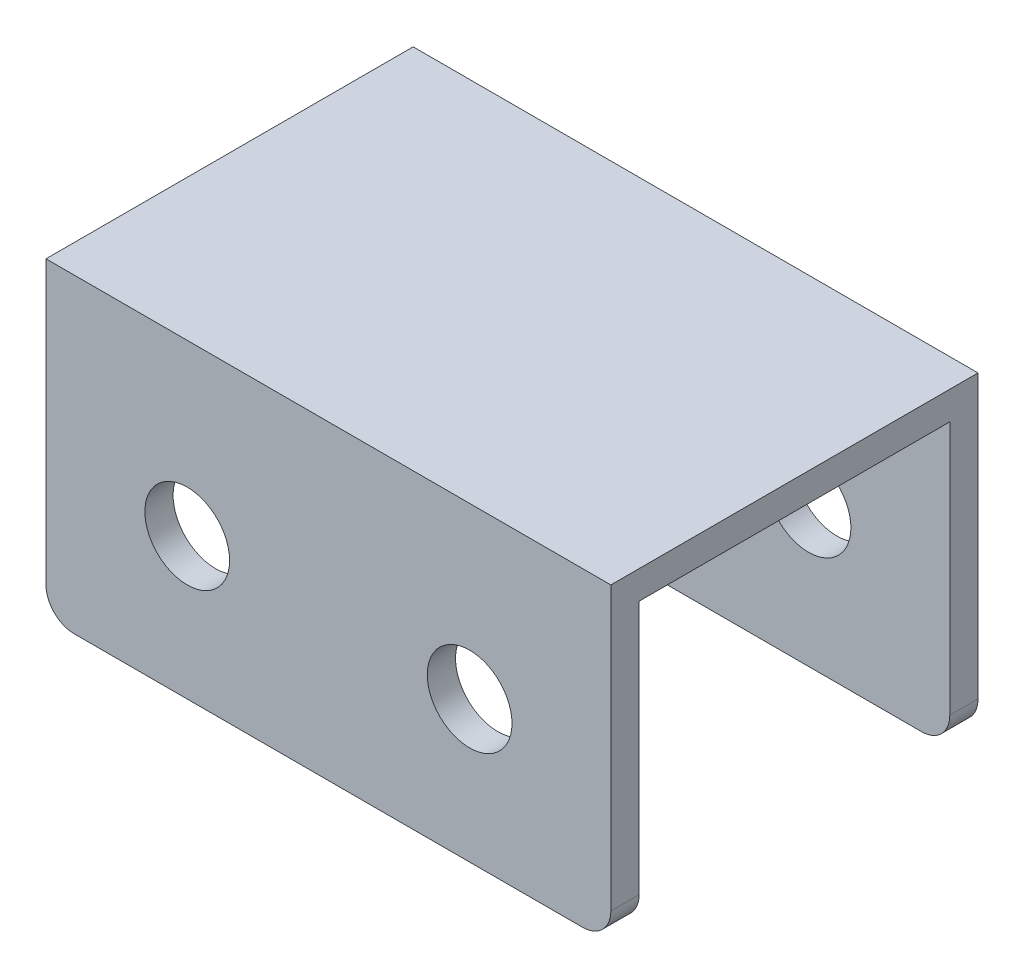
ISO-10303-21;
HEADER;
FILE_DESCRIPTION(('STEP AP214'),'2;1');
FILE_NAME('part.step','',(''),(''),'','','');
FILE_SCHEMA(('AUTOMOTIVE_DESIGN { 1 0 10303 214 1 1 1 1 }'));
ENDSEC;
DATA;
#1=APPLICATION_CONTEXT('core data for automotive mechanical design processes');
#2=APPLICATION_PROTOCOL_DEFINITION('international standard','automotive_design',2000,#1);
#3=PRODUCT_CONTEXT('',#1,'mechanical');
#4=PRODUCT('Part','Part','',(#3));
#5=PRODUCT_RELATED_PRODUCT_CATEGORY('part','',(#4));
#6=PRODUCT_DEFINITION_FORMATION('','',#4);
#7=PRODUCT_DEFINITION_CONTEXT('part definition',#1,'design');
#8=PRODUCT_DEFINITION('design','',#6,#7);
#9=PRODUCT_DEFINITION_SHAPE('','',#8);
#10=(LENGTH_UNIT() NAMED_UNIT(*) SI_UNIT(.MILLI.,.METRE.));
#11=(NAMED_UNIT(*) PLANE_ANGLE_UNIT() SI_UNIT($,.RADIAN.));
#12=(NAMED_UNIT(*) SI_UNIT($,.STERADIAN.) SOLID_ANGLE_UNIT());
#13=UNCERTAINTY_MEASURE_WITH_UNIT(LENGTH_MEASURE(1.E-05),#10,'distance_accuracy_value','');
#14=(GEOMETRIC_REPRESENTATION_CONTEXT(3) GLOBAL_UNCERTAINTY_ASSIGNED_CONTEXT((#13)) GLOBAL_UNIT_ASSIGNED_CONTEXT((#10,
#11,#12)) REPRESENTATION_CONTEXT('',''));
#15=CARTESIAN_POINT('',(0.,0.,0.));
#16=DIRECTION('',(0.,0.,1.));
#17=DIRECTION('',(1.,0.,0.));
#18=AXIS2_PLACEMENT_3D('',#15,#16,#17);
#19=CARTESIAN_POINT('',(50.,0.,-27.5));
#20=DIRECTION('',(0.,0.,-1.));
#21=DIRECTION('',(0.,1.,0.));
#22=AXIS2_PLACEMENT_3D('',#19,#20,#21);
#23=PLANE('',#22);
#24=CARTESIAN_POINT('',(25.,-25.,-27.5));
#25=DIRECTION('',(0.,0.,-1.));
#26=DIRECTION('',(0.,1.,0.));
#27=AXIS2_PLACEMENT_3D('',#24,#25,#26);
#28=CIRCLE('',#27,7.5);
#29=CARTESIAN_POINT('',(25.,-17.5,-27.5));
#30=VERTEX_POINT('',#29);
#31=EDGE_CURVE('E194',#30,#30,#28,.T.);
#32=ORIENTED_EDGE('',*,*,#31,.T.);
#33=EDGE_LOOP('',(#32));
#34=FACE_BOUND('',#33,.T.);
#35=CARTESIAN_POINT('',(-25.,-25.,-27.5));
#36=DIRECTION('',(0.,0.,-1.));
#37=DIRECTION('',(0.,1.,0.));
#38=AXIS2_PLACEMENT_3D('',#35,#36,#37);
#39=CIRCLE('',#38,7.5);
#40=CARTESIAN_POINT('',(-25.,-17.5,-27.5));
#41=VERTEX_POINT('',#40);
#42=EDGE_CURVE('E161',#41,#41,#39,.T.);
#43=ORIENTED_EDGE('',*,*,#42,.T.);
#44=EDGE_LOOP('',(#43));
#45=FACE_BOUND('',#44,.T.);
#46=DIRECTION('',(-1.,0.,0.));
#47=VECTOR('',#46,1.);
#48=CARTESIAN_POINT('',(50.,-50.,-27.5));
#49=LINE('',#48,#47);
#50=CARTESIAN_POINT('',(45.,-50.,-27.5));
#51=VERTEX_POINT('',#50);
#52=CARTESIAN_POINT('',(-45.,-50.,-27.5));
#53=VERTEX_POINT('',#52);
#54=EDGE_CURVE('E183',#51,#53,#49,.T.);
#55=ORIENTED_EDGE('',*,*,#54,.F.);
#56=CARTESIAN_POINT('',(45.,-45.,-27.5));
#57=DIRECTION('',(0.,0.,-1.));
#58=DIRECTION('',(0.,1.,0.));
#59=AXIS2_PLACEMENT_3D('',#56,#57,#58);
#60=CIRCLE('',#59,5.);
#61=CARTESIAN_POINT('',(50.,-45.,-27.5));
#62=VERTEX_POINT('',#61);
#63=EDGE_CURVE('E202',#51,#62,#60,.F.);
#64=ORIENTED_EDGE('',*,*,#63,.T.);
#65=DIRECTION('',(0.,-1.,0.));
#66=VECTOR('',#65,1.);
#67=CARTESIAN_POINT('',(50.,0.,-27.5));
#68=LINE('',#67,#66);
#69=CARTESIAN_POINT('',(50.,0.,-27.5));
#70=VERTEX_POINT('',#69);
#71=EDGE_CURVE('E143',#70,#62,#68,.T.);
#72=ORIENTED_EDGE('',*,*,#71,.F.);
#73=DIRECTION('',(-1.,0.,0.));
#74=VECTOR('',#73,1.);
#75=CARTESIAN_POINT('',(50.,0.,-27.5));
#76=LINE('',#75,#74);
#77=CARTESIAN_POINT('',(-50.,0.,-27.5));
#78=VERTEX_POINT('',#77);
#79=EDGE_CURVE('E157',#70,#78,#76,.T.);
#80=ORIENTED_EDGE('',*,*,#79,.T.);
#81=DIRECTION('',(0.,-1.,0.));
#82=VECTOR('',#81,1.);
#83=CARTESIAN_POINT('',(-50.,0.,-27.5));
#84=LINE('',#83,#82);
#85=CARTESIAN_POINT('',(-50.,-45.,-27.5));
#86=VERTEX_POINT('',#85);
#87=EDGE_CURVE('E158',#78,#86,#84,.T.);
#88=ORIENTED_EDGE('',*,*,#87,.T.);
#89=CARTESIAN_POINT('',(-45.,-45.,-27.5));
#90=DIRECTION('',(0.,0.,-1.));
#91=DIRECTION('',(0.,1.,0.));
#92=AXIS2_PLACEMENT_3D('',#89,#90,#91);
#93=CIRCLE('',#92,5.);
#94=EDGE_CURVE('E200',#86,#53,#93,.F.);
#95=ORIENTED_EDGE('',*,*,#94,.T.);
#96=EDGE_LOOP('',(#55,#64,#72,#80,#88,#95));
#97=FACE_BOUND('',#96,.T.);
#98=ADVANCED_FACE('F32',(#34,#45,#97),#23,.F.);
#99=CARTESIAN_POINT('',(50.,-50.,-32.5));
#100=DIRECTION('',(0.,-1.,0.));
#101=DIRECTION('',(0.,0.,-1.));
#102=AXIS2_PLACEMENT_3D('',#99,#100,#101);
#103=PLANE('',#102);
#104=DIRECTION('',(-1.,0.,0.));
#105=VECTOR('',#104,1.);
#106=CARTESIAN_POINT('',(50.,-50.,-32.5));
#107=LINE('',#106,#105);
#108=CARTESIAN_POINT('',(45.,-50.,-32.5));
#109=VERTEX_POINT('',#108);
#110=CARTESIAN_POINT('',(-45.,-50.,-32.5));
#111=VERTEX_POINT('',#110);
#112=EDGE_CURVE('E132',#109,#111,#107,.T.);
#113=ORIENTED_EDGE('',*,*,#112,.F.);
#114=DIRECTION('',(0.,0.,1.));
#115=VECTOR('',#114,1.);
#116=CARTESIAN_POINT('',(45.,-50.,-27.5));
#117=LINE('',#116,#115);
#118=EDGE_CURVE('E197',#109,#51,#117,.T.);
#119=ORIENTED_EDGE('',*,*,#118,.T.);
#120=ORIENTED_EDGE('',*,*,#54,.T.);
#121=DIRECTION('',(0.,0.,1.));
#122=VECTOR('',#121,1.);
#123=CARTESIAN_POINT('',(-45.,-50.,-32.5));
#124=LINE('',#123,#122);
#125=EDGE_CURVE('E186',#53,#111,#124,.F.);
#126=ORIENTED_EDGE('',*,*,#125,.T.);
#127=EDGE_LOOP('',(#113,#119,#120,#126));
#128=FACE_BOUND('',#127,.T.);
#129=ADVANCED_FACE('F254',(#128),#103,.T.);
#130=CARTESIAN_POINT('',(50.,0.,-32.5));
#131=DIRECTION('',(0.,0.,-1.));
#132=DIRECTION('',(0.,1.,0.));
#133=AXIS2_PLACEMENT_3D('',#130,#131,#132);
#134=PLANE('',#133);
#135=CARTESIAN_POINT('',(25.,-25.,-32.5));
#136=DIRECTION('',(0.,0.,1.));
#137=DIRECTION('',(1.,0.,0.));
#138=AXIS2_PLACEMENT_3D('',#135,#136,#137);
#139=CIRCLE('',#138,7.5);
#140=CARTESIAN_POINT('',(32.5,-25.,-32.5));
#141=VERTEX_POINT('',#140);
#142=EDGE_CURVE('E195',#141,#141,#139,.T.);
#143=ORIENTED_EDGE('',*,*,#142,.T.);
#144=EDGE_LOOP('',(#143));
#145=FACE_BOUND('',#144,.T.);
#146=CARTESIAN_POINT('',(-25.,-25.,-32.5));
#147=DIRECTION('',(0.,0.,1.));
#148=DIRECTION('',(1.,0.,0.));
#149=AXIS2_PLACEMENT_3D('',#146,#147,#148);
#150=CIRCLE('',#149,7.5);
#151=CARTESIAN_POINT('',(-17.5,-25.,-32.5));
#152=VERTEX_POINT('',#151);
#153=EDGE_CURVE('E190',#152,#152,#150,.T.);
#154=ORIENTED_EDGE('',*,*,#153,.T.);
#155=EDGE_LOOP('',(#154));
#156=FACE_BOUND('',#155,.T.);
#157=DIRECTION('',(0.,-1.,0.));
#158=VECTOR('',#157,1.);
#159=CARTESIAN_POINT('',(50.,0.,-32.5));
#160=LINE('',#159,#158);
#161=CARTESIAN_POINT('',(50.,5.,-32.5));
#162=VERTEX_POINT('',#161);
#163=CARTESIAN_POINT('',(50.,-45.,-32.5));
#164=VERTEX_POINT('',#163);
#165=EDGE_CURVE('E124',#162,#164,#160,.T.);
#166=ORIENTED_EDGE('',*,*,#165,.T.);
#167=CARTESIAN_POINT('',(45.,-45.,-32.5));
#168=DIRECTION('',(0.,0.,-1.));
#169=DIRECTION('',(0.,1.,0.));
#170=AXIS2_PLACEMENT_3D('',#167,#168,#169);
#171=CIRCLE('',#170,5.);
#172=EDGE_CURVE('E209',#164,#109,#171,.T.);
#173=ORIENTED_EDGE('',*,*,#172,.T.);
#174=ORIENTED_EDGE('',*,*,#112,.T.);
#175=CARTESIAN_POINT('',(-45.,-45.,-32.5));
#176=DIRECTION('',(0.,0.,-1.));
#177=DIRECTION('',(0.,1.,0.));
#178=AXIS2_PLACEMENT_3D('',#175,#176,#177);
#179=CIRCLE('',#178,5.);
#180=CARTESIAN_POINT('',(-50.,-45.,-32.5));
#181=VERTEX_POINT('',#180);
#182=EDGE_CURVE('E207',#111,#181,#179,.T.);
#183=ORIENTED_EDGE('',*,*,#182,.T.);
#184=DIRECTION('',(0.,-1.,0.));
#185=VECTOR('',#184,1.);
#186=CARTESIAN_POINT('',(-50.,0.,-32.5));
#187=LINE('',#186,#185);
#188=CARTESIAN_POINT('',(-50.,5.,-32.5));
#189=VERTEX_POINT('',#188);
#190=EDGE_CURVE('E127',#189,#181,#187,.T.);
#191=ORIENTED_EDGE('',*,*,#190,.F.);
#192=DIRECTION('',(-1.,0.,0.));
#193=VECTOR('',#192,1.);
#194=CARTESIAN_POINT('',(50.,5.,-32.5));
#195=LINE('',#194,#193);
#196=EDGE_CURVE('E121',#162,#189,#195,.T.);
#197=ORIENTED_EDGE('',*,*,#196,.F.);
#198=EDGE_LOOP('',(#166,#173,#174,#183,#191,#197));
#199=FACE_BOUND('',#198,.T.);
#200=ADVANCED_FACE('F123',(#145,#156,#199),#134,.T.);
#201=CARTESIAN_POINT('',(50.,5.,27.5));
#202=DIRECTION('',(0.,1.,0.));
#203=DIRECTION('',(0.,0.,1.));
#204=AXIS2_PLACEMENT_3D('',#201,#202,#203);
#205=PLANE('',#204);
#206=DIRECTION('',(0.,0.,-1.));
#207=VECTOR('',#206,1.);
#208=CARTESIAN_POINT('',(-50.,5.,27.5));
#209=LINE('',#208,#207);
#210=CARTESIAN_POINT('',(-50.,5.,32.5));
#211=VERTEX_POINT('',#210);
#212=EDGE_CURVE('E163',#211,#189,#209,.T.);
#213=ORIENTED_EDGE('',*,*,#212,.F.);
#214=DIRECTION('',(-1.,0.,0.));
#215=VECTOR('',#214,1.);
#216=CARTESIAN_POINT('',(50.,5.,32.5));
#217=LINE('',#216,#215);
#218=CARTESIAN_POINT('',(50.,5.,32.5));
#219=VERTEX_POINT('',#218);
#220=EDGE_CURVE('E133',#219,#211,#217,.T.);
#221=ORIENTED_EDGE('',*,*,#220,.F.);
#222=DIRECTION('',(0.,0.,-1.));
#223=VECTOR('',#222,1.);
#224=CARTESIAN_POINT('',(50.,5.,27.5));
#225=LINE('',#224,#223);
#226=EDGE_CURVE('E140',#219,#162,#225,.T.);
#227=ORIENTED_EDGE('',*,*,#226,.T.);
#228=ORIENTED_EDGE('',*,*,#196,.T.);
#229=EDGE_LOOP('',(#213,#221,#227,#228));
#230=FACE_BOUND('',#229,.T.);
#231=ADVANCED_FACE('F146',(#230),#205,.T.);
#232=CARTESIAN_POINT('',(50.,-50.,32.5));
#233=DIRECTION('',(0.,0.,1.));
#234=DIRECTION('',(0.,-1.,0.));
#235=AXIS2_PLACEMENT_3D('',#232,#233,#234);
#236=PLANE('',#235);
#237=CARTESIAN_POINT('',(25.,-25.,32.5));
#238=DIRECTION('',(0.,0.,1.));
#239=DIRECTION('',(1.,0.,0.));
#240=AXIS2_PLACEMENT_3D('',#237,#238,#239);
#241=CIRCLE('',#240,7.5);
#242=CARTESIAN_POINT('',(32.5,-25.,32.5));
#243=VERTEX_POINT('',#242);
#244=EDGE_CURVE('E292',#243,#243,#241,.T.);
#245=ORIENTED_EDGE('',*,*,#244,.F.);
#246=EDGE_LOOP('',(#245));
#247=FACE_BOUND('',#246,.T.);
#248=CARTESIAN_POINT('',(-25.,-25.,32.5));
#249=DIRECTION('',(0.,0.,1.));
#250=DIRECTION('',(1.,0.,0.));
#251=AXIS2_PLACEMENT_3D('',#248,#249,#250);
#252=CIRCLE('',#251,7.5);
#253=CARTESIAN_POINT('',(-17.5,-25.,32.5));
#254=VERTEX_POINT('',#253);
#255=EDGE_CURVE('E286',#254,#254,#252,.T.);
#256=ORIENTED_EDGE('',*,*,#255,.F.);
#257=EDGE_LOOP('',(#256));
#258=FACE_BOUND('',#257,.T.);
#259=DIRECTION('',(0.,1.,0.));
#260=VECTOR('',#259,1.);
#261=CARTESIAN_POINT('',(-50.,-50.,32.5));
#262=LINE('',#261,#260);
#263=CARTESIAN_POINT('',(-50.,-45.,32.5));
#264=VERTEX_POINT('',#263);
#265=EDGE_CURVE('E165',#264,#211,#262,.T.);
#266=ORIENTED_EDGE('',*,*,#265,.F.);
#267=CARTESIAN_POINT('',(-45.,-45.,32.5));
#268=DIRECTION('',(0.,0.,1.));
#269=DIRECTION('',(0.,-1.,0.));
#270=AXIS2_PLACEMENT_3D('',#267,#268,#269);
#271=CIRCLE('',#270,5.);
#272=CARTESIAN_POINT('',(-45.,-50.,32.5));
#273=VERTEX_POINT('',#272);
#274=EDGE_CURVE('E219',#264,#273,#271,.T.);
#275=ORIENTED_EDGE('',*,*,#274,.T.);
#276=DIRECTION('',(-1.,0.,0.));
#277=VECTOR('',#276,1.);
#278=CARTESIAN_POINT('',(50.,-50.,32.5));
#279=LINE('',#278,#277);
#280=CARTESIAN_POINT('',(45.,-50.,32.5));
#281=VERTEX_POINT('',#280);
#282=EDGE_CURVE('E178',#281,#273,#279,.T.);
#283=ORIENTED_EDGE('',*,*,#282,.F.);
#284=CARTESIAN_POINT('',(45.,-45.,32.5));
#285=DIRECTION('',(0.,0.,1.));
#286=DIRECTION('',(0.,-1.,0.));
#287=AXIS2_PLACEMENT_3D('',#284,#285,#286);
#288=CIRCLE('',#287,5.);
#289=CARTESIAN_POINT('',(50.,-45.,32.5));
#290=VERTEX_POINT('',#289);
#291=EDGE_CURVE('E217',#281,#290,#288,.T.);
#292=ORIENTED_EDGE('',*,*,#291,.T.);
#293=DIRECTION('',(0.,1.,0.));
#294=VECTOR('',#293,1.);
#295=CARTESIAN_POINT('',(50.,-50.,32.5));
#296=LINE('',#295,#294);
#297=EDGE_CURVE('E148',#290,#219,#296,.T.);
#298=ORIENTED_EDGE('',*,*,#297,.T.);
#299=ORIENTED_EDGE('',*,*,#220,.T.);
#300=EDGE_LOOP('',(#266,#275,#283,#292,#298,#299));
#301=FACE_BOUND('',#300,.T.);
#302=ADVANCED_FACE('F230',(#247,#258,#301),#236,.T.);
#303=CARTESIAN_POINT('',(50.,-50.,27.5));
#304=DIRECTION('',(0.,-1.,0.));
#305=DIRECTION('',(0.,0.,-1.));
#306=AXIS2_PLACEMENT_3D('',#303,#304,#305);
#307=PLANE('',#306);
#308=ORIENTED_EDGE('',*,*,#282,.T.);
#309=DIRECTION('',(0.,0.,1.));
#310=VECTOR('',#309,1.);
#311=CARTESIAN_POINT('',(-45.,-50.,27.5));
#312=LINE('',#311,#310);
#313=CARTESIAN_POINT('',(-45.,-50.,27.5));
#314=VERTEX_POINT('',#313);
#315=EDGE_CURVE('E47',#273,#314,#312,.F.);
#316=ORIENTED_EDGE('',*,*,#315,.T.);
#317=DIRECTION('',(-1.,0.,0.));
#318=VECTOR('',#317,1.);
#319=CARTESIAN_POINT('',(50.,-50.,27.5));
#320=LINE('',#319,#318);
#321=CARTESIAN_POINT('',(45.,-50.,27.5));
#322=VERTEX_POINT('',#321);
#323=EDGE_CURVE('E176',#322,#314,#320,.T.);
#324=ORIENTED_EDGE('',*,*,#323,.F.);
#325=DIRECTION('',(0.,0.,1.));
#326=VECTOR('',#325,1.);
#327=CARTESIAN_POINT('',(45.,-50.,32.5));
#328=LINE('',#327,#326);
#329=EDGE_CURVE('E221',#322,#281,#328,.T.);
#330=ORIENTED_EDGE('',*,*,#329,.T.);
#331=EDGE_LOOP('',(#308,#316,#324,#330));
#332=FACE_BOUND('',#331,.T.);
#333=ADVANCED_FACE('F226',(#332),#307,.T.);
#334=CARTESIAN_POINT('',(50.,-50.,27.5));
#335=DIRECTION('',(0.,0.,1.));
#336=DIRECTION('',(0.,-1.,0.));
#337=AXIS2_PLACEMENT_3D('',#334,#335,#336);
#338=PLANE('',#337);
#339=CARTESIAN_POINT('',(25.,-25.,27.5));
#340=DIRECTION('',(0.,0.,1.));
#341=DIRECTION('',(0.,-1.,0.));
#342=AXIS2_PLACEMENT_3D('',#339,#340,#341);
#343=CIRCLE('',#342,7.5);
#344=CARTESIAN_POINT('',(25.,-32.5,27.5));
#345=VERTEX_POINT('',#344);
#346=EDGE_CURVE('E191',#345,#345,#343,.T.);
#347=ORIENTED_EDGE('',*,*,#346,.T.);
#348=EDGE_LOOP('',(#347));
#349=FACE_BOUND('',#348,.T.);
#350=CARTESIAN_POINT('',(-25.,-25.,27.5));
#351=DIRECTION('',(0.,0.,1.));
#352=DIRECTION('',(0.,-1.,0.));
#353=AXIS2_PLACEMENT_3D('',#350,#351,#352);
#354=CIRCLE('',#353,7.5);
#355=CARTESIAN_POINT('',(-25.,-32.5,27.5));
#356=VERTEX_POINT('',#355);
#357=EDGE_CURVE('E187',#356,#356,#354,.T.);
#358=ORIENTED_EDGE('',*,*,#357,.T.);
#359=EDGE_LOOP('',(#358));
#360=FACE_BOUND('',#359,.T.);
#361=ORIENTED_EDGE('',*,*,#323,.T.);
#362=CARTESIAN_POINT('',(-45.,-45.,27.5));
#363=DIRECTION('',(0.,0.,1.));
#364=DIRECTION('',(0.,-1.,0.));
#365=AXIS2_PLACEMENT_3D('',#362,#363,#364);
#366=CIRCLE('',#365,5.);
#367=CARTESIAN_POINT('',(-50.,-45.,27.5));
#368=VERTEX_POINT('',#367);
#369=EDGE_CURVE('E11',#314,#368,#366,.F.);
#370=ORIENTED_EDGE('',*,*,#369,.T.);
#371=DIRECTION('',(0.,1.,0.));
#372=VECTOR('',#371,1.);
#373=CARTESIAN_POINT('',(-50.,-50.,27.5));
#374=LINE('',#373,#372);
#375=CARTESIAN_POINT('',(-50.,0.,27.5));
#376=VERTEX_POINT('',#375);
#377=EDGE_CURVE('E167',#368,#376,#374,.T.);
#378=ORIENTED_EDGE('',*,*,#377,.T.);
#379=DIRECTION('',(-1.,0.,0.));
#380=VECTOR('',#379,1.);
#381=CARTESIAN_POINT('',(50.,0.,27.5));
#382=LINE('',#381,#380);
#383=CARTESIAN_POINT('',(50.,0.,27.5));
#384=VERTEX_POINT('',#383);
#385=EDGE_CURVE('E173',#384,#376,#382,.T.);
#386=ORIENTED_EDGE('',*,*,#385,.F.);
#387=DIRECTION('',(0.,1.,0.));
#388=VECTOR('',#387,1.);
#389=CARTESIAN_POINT('',(50.,-50.,27.5));
#390=LINE('',#389,#388);
#391=CARTESIAN_POINT('',(50.,-45.,27.5));
#392=VERTEX_POINT('',#391);
#393=EDGE_CURVE('E150',#392,#384,#390,.T.);
#394=ORIENTED_EDGE('',*,*,#393,.F.);
#395=CARTESIAN_POINT('',(45.,-45.,27.5));
#396=DIRECTION('',(0.,0.,1.));
#397=DIRECTION('',(0.,-1.,0.));
#398=AXIS2_PLACEMENT_3D('',#395,#396,#397);
#399=CIRCLE('',#398,5.);
#400=EDGE_CURVE('E40',#392,#322,#399,.F.);
#401=ORIENTED_EDGE('',*,*,#400,.T.);
#402=EDGE_LOOP('',(#361,#370,#378,#386,#394,#401));
#403=FACE_BOUND('',#402,.T.);
#404=ADVANCED_FACE('F241',(#349,#360,#403),#338,.F.);
#405=CARTESIAN_POINT('',(50.,0.,27.5));
#406=DIRECTION('',(0.,1.,0.));
#407=DIRECTION('',(0.,0.,1.));
#408=AXIS2_PLACEMENT_3D('',#405,#406,#407);
#409=PLANE('',#408);
#410=DIRECTION('',(0.,0.,-1.));
#411=VECTOR('',#410,1.);
#412=CARTESIAN_POINT('',(-50.,0.,27.5));
#413=LINE('',#412,#411);
#414=EDGE_CURVE('E169',#376,#78,#413,.T.);
#415=ORIENTED_EDGE('',*,*,#414,.T.);
#416=ORIENTED_EDGE('',*,*,#79,.F.);
#417=DIRECTION('',(0.,0.,-1.));
#418=VECTOR('',#417,1.);
#419=CARTESIAN_POINT('',(50.,0.,27.5));
#420=LINE('',#419,#418);
#421=EDGE_CURVE('E155',#384,#70,#420,.T.);
#422=ORIENTED_EDGE('',*,*,#421,.F.);
#423=ORIENTED_EDGE('',*,*,#385,.T.);
#424=EDGE_LOOP('',(#415,#416,#422,#423));
#425=FACE_BOUND('',#424,.T.);
#426=ADVANCED_FACE('F244',(#425),#409,.F.);
#427=CARTESIAN_POINT('',(50.,0.,0.));
#428=DIRECTION('',(-1.,0.,0.));
#429=DIRECTION('',(0.,0.,1.));
#430=AXIS2_PLACEMENT_3D('',#427,#428,#429);
#431=PLANE('',#430);
#432=ORIENTED_EDGE('',*,*,#71,.T.);
#433=DIRECTION('',(0.,0.,1.));
#434=VECTOR('',#433,1.);
#435=CARTESIAN_POINT('',(50.,-45.,-32.5));
#436=LINE('',#435,#434);
#437=EDGE_CURVE('E142',#62,#164,#436,.F.);
#438=ORIENTED_EDGE('',*,*,#437,.T.);
#439=ORIENTED_EDGE('',*,*,#165,.F.);
#440=ORIENTED_EDGE('',*,*,#226,.F.);
#441=ORIENTED_EDGE('',*,*,#297,.F.);
#442=DIRECTION('',(0.,0.,1.));
#443=VECTOR('',#442,1.);
#444=CARTESIAN_POINT('',(50.,-45.,27.5));
#445=LINE('',#444,#443);
#446=EDGE_CURVE('E204',#290,#392,#445,.F.);
#447=ORIENTED_EDGE('',*,*,#446,.T.);
#448=ORIENTED_EDGE('',*,*,#393,.T.);
#449=ORIENTED_EDGE('',*,*,#421,.T.);
#450=EDGE_LOOP('',(#432,#438,#439,#440,#441,#447,#448,#449));
#451=FACE_BOUND('',#450,.T.);
#452=ADVANCED_FACE('F138',(#451),#431,.F.);
#453=CARTESIAN_POINT('',(-50.,0.,0.));
#454=DIRECTION('',(-1.,0.,0.));
#455=DIRECTION('',(0.,0.,1.));
#456=AXIS2_PLACEMENT_3D('',#453,#454,#455);
#457=PLANE('',#456);
#458=ORIENTED_EDGE('',*,*,#190,.T.);
#459=DIRECTION('',(0.,0.,1.));
#460=VECTOR('',#459,1.);
#461=CARTESIAN_POINT('',(-50.,-45.,0.));
#462=LINE('',#461,#460);
#463=EDGE_CURVE('E214',#181,#86,#462,.T.);
#464=ORIENTED_EDGE('',*,*,#463,.T.);
#465=ORIENTED_EDGE('',*,*,#87,.F.);
#466=ORIENTED_EDGE('',*,*,#414,.F.);
#467=ORIENTED_EDGE('',*,*,#377,.F.);
#468=DIRECTION('',(0.,0.,1.));
#469=VECTOR('',#468,1.);
#470=CARTESIAN_POINT('',(-50.,-45.,0.));
#471=LINE('',#470,#469);
#472=EDGE_CURVE('E211',#368,#264,#471,.T.);
#473=ORIENTED_EDGE('',*,*,#472,.T.);
#474=ORIENTED_EDGE('',*,*,#265,.T.);
#475=ORIENTED_EDGE('',*,*,#212,.T.);
#476=EDGE_LOOP('',(#458,#464,#465,#466,#467,#473,#474,#475));
#477=FACE_BOUND('',#476,.T.);
#478=ADVANCED_FACE('F237',(#477),#457,.T.);
#479=CARTESIAN_POINT('',(-25.,-25.,-32.5));
#480=DIRECTION('',(0.,0.,1.));
#481=DIRECTION('',(1.,0.,0.));
#482=AXIS2_PLACEMENT_3D('',#479,#480,#481);
#483=CYLINDRICAL_SURFACE('',#482,7.5);
#484=ORIENTED_EDGE('',*,*,#255,.T.);
#485=EDGE_LOOP('',(#484));
#486=FACE_BOUND('',#485,.T.);
#487=ORIENTED_EDGE('',*,*,#357,.F.);
#488=EDGE_LOOP('',(#487));
#489=FACE_BOUND('',#488,.T.);
#490=ADVANCED_FACE('F304',(#486,#489),#483,.F.);
#491=ORIENTED_EDGE('',*,*,#153,.F.);
#492=EDGE_LOOP('',(#491));
#493=FACE_BOUND('',#492,.T.);
#494=ORIENTED_EDGE('',*,*,#42,.F.);
#495=EDGE_LOOP('',(#494));
#496=FACE_BOUND('',#495,.T.);
#497=ADVANCED_FACE('F307',(#493,#496),#483,.F.);
#498=CARTESIAN_POINT('',(25.,-25.,-32.5));
#499=DIRECTION('',(0.,0.,1.));
#500=DIRECTION('',(1.,0.,0.));
#501=AXIS2_PLACEMENT_3D('',#498,#499,#500);
#502=CYLINDRICAL_SURFACE('',#501,7.5);
#503=ORIENTED_EDGE('',*,*,#244,.T.);
#504=EDGE_LOOP('',(#503));
#505=FACE_BOUND('',#504,.T.);
#506=ORIENTED_EDGE('',*,*,#346,.F.);
#507=EDGE_LOOP('',(#506));
#508=FACE_BOUND('',#507,.T.);
#509=ADVANCED_FACE('F296',(#505,#508),#502,.F.);
#510=ORIENTED_EDGE('',*,*,#142,.F.);
#511=EDGE_LOOP('',(#510));
#512=FACE_BOUND('',#511,.T.);
#513=ORIENTED_EDGE('',*,*,#31,.F.);
#514=EDGE_LOOP('',(#513));
#515=FACE_BOUND('',#514,.T.);
#516=ADVANCED_FACE('F269',(#512,#515),#502,.F.);
#517=CARTESIAN_POINT('',(45.,-45.,-32.5));
#518=DIRECTION('',(0.,0.,-1.));
#519=DIRECTION('',(-1.,0.,0.));
#520=AXIS2_PLACEMENT_3D('',#517,#518,#519);
#521=CYLINDRICAL_SURFACE('',#520,5.);
#522=ORIENTED_EDGE('',*,*,#172,.F.);
#523=ORIENTED_EDGE('',*,*,#437,.F.);
#524=ORIENTED_EDGE('',*,*,#63,.F.);
#525=ORIENTED_EDGE('',*,*,#118,.F.);
#526=EDGE_LOOP('',(#522,#523,#524,#525));
#527=FACE_BOUND('',#526,.T.);
#528=ADVANCED_FACE('F266',(#527),#521,.T.);
#529=CARTESIAN_POINT('',(-45.,-45.,0.));
#530=DIRECTION('',(0.,0.,1.));
#531=DIRECTION('',(1.,0.,0.));
#532=AXIS2_PLACEMENT_3D('',#529,#530,#531);
#533=CYLINDRICAL_SURFACE('',#532,5.);
#534=ORIENTED_EDGE('',*,*,#182,.F.);
#535=ORIENTED_EDGE('',*,*,#125,.F.);
#536=ORIENTED_EDGE('',*,*,#94,.F.);
#537=ORIENTED_EDGE('',*,*,#463,.F.);
#538=EDGE_LOOP('',(#534,#535,#536,#537));
#539=FACE_BOUND('',#538,.T.);
#540=ADVANCED_FACE('F252',(#539),#533,.T.);
#541=CARTESIAN_POINT('',(-45.,-45.,0.));
#542=DIRECTION('',(0.,0.,1.));
#543=DIRECTION('',(1.,0.,0.));
#544=AXIS2_PLACEMENT_3D('',#541,#542,#543);
#545=CYLINDRICAL_SURFACE('',#544,5.);
#546=ORIENTED_EDGE('',*,*,#369,.F.);
#547=ORIENTED_EDGE('',*,*,#315,.F.);
#548=ORIENTED_EDGE('',*,*,#274,.F.);
#549=ORIENTED_EDGE('',*,*,#472,.F.);
#550=EDGE_LOOP('',(#546,#547,#548,#549));
#551=FACE_BOUND('',#550,.T.);
#552=ADVANCED_FACE('F234',(#551),#545,.T.);
#553=CARTESIAN_POINT('',(45.,-45.,27.5));
#554=DIRECTION('',(0.,0.,-1.));
#555=DIRECTION('',(-1.,0.,0.));
#556=AXIS2_PLACEMENT_3D('',#553,#554,#555);
#557=CYLINDRICAL_SURFACE('',#556,5.);
#558=ORIENTED_EDGE('',*,*,#400,.F.);
#559=ORIENTED_EDGE('',*,*,#446,.F.);
#560=ORIENTED_EDGE('',*,*,#291,.F.);
#561=ORIENTED_EDGE('',*,*,#329,.F.);
#562=EDGE_LOOP('',(#558,#559,#560,#561));
#563=FACE_BOUND('',#562,.T.);
#564=ADVANCED_FACE('F34',(#563),#557,.T.);
#565=CLOSED_SHELL('',(#98,#129,#200,#231,#302,#333,#404,#426,#452,#478,#490,#497,#509,#516,#528,
#540,#552,#564));
#566=MANIFOLD_SOLID_BREP('B2',#565);
#567=ADVANCED_BREP_SHAPE_REPRESENTATION('',(#18,#566),#14);
#568=SHAPE_DEFINITION_REPRESENTATION(#9,#567);
ENDSEC;
END-ISO-10303-21;
